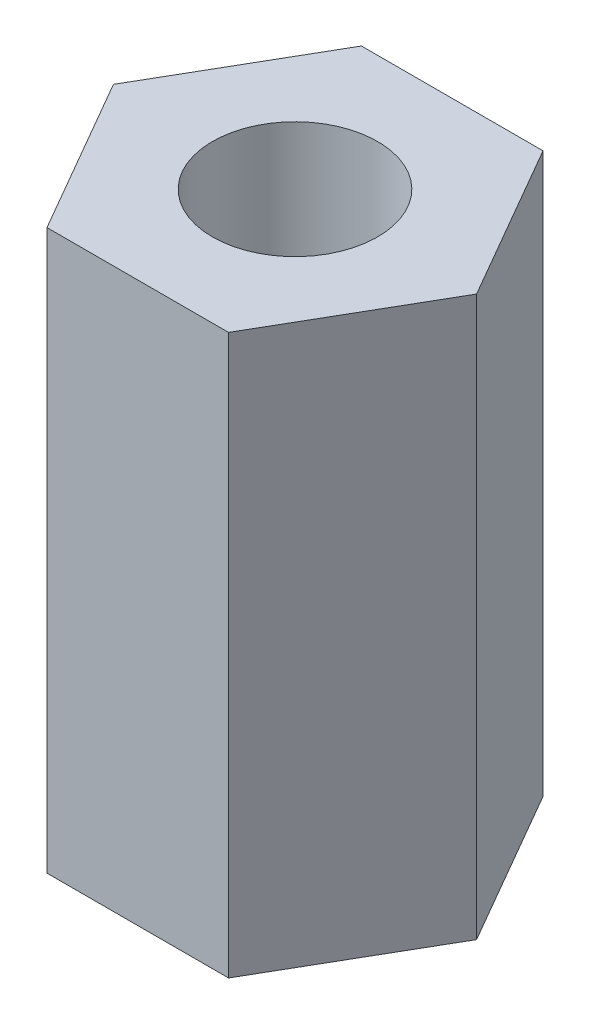
ISO-10303-21;
HEADER;
FILE_DESCRIPTION(('STEP AP214'),'2;1');
FILE_NAME('part.step','',(''),(''),'','','');
FILE_SCHEMA(('AUTOMOTIVE_DESIGN { 1 0 10303 214 1 1 1 1 }'));
ENDSEC;
DATA;
#1=APPLICATION_CONTEXT('core data for automotive mechanical design processes');
#2=APPLICATION_PROTOCOL_DEFINITION('international standard','automotive_design',2000,#1);
#3=PRODUCT_CONTEXT('',#1,'mechanical');
#4=PRODUCT('Part','Part','',(#3));
#5=PRODUCT_RELATED_PRODUCT_CATEGORY('part','',(#4));
#6=PRODUCT_DEFINITION_FORMATION('','',#4);
#7=PRODUCT_DEFINITION_CONTEXT('part definition',#1,'design');
#8=PRODUCT_DEFINITION('design','',#6,#7);
#9=PRODUCT_DEFINITION_SHAPE('','',#8);
#10=(LENGTH_UNIT() NAMED_UNIT(*) SI_UNIT(.MILLI.,.METRE.));
#11=(NAMED_UNIT(*) PLANE_ANGLE_UNIT() SI_UNIT($,.RADIAN.));
#12=(NAMED_UNIT(*) SI_UNIT($,.STERADIAN.) SOLID_ANGLE_UNIT());
#13=UNCERTAINTY_MEASURE_WITH_UNIT(LENGTH_MEASURE(1.E-05),#10,'distance_accuracy_value','');
#14=(GEOMETRIC_REPRESENTATION_CONTEXT(3) GLOBAL_UNCERTAINTY_ASSIGNED_CONTEXT((#13)) GLOBAL_UNIT_ASSIGNED_CONTEXT((#10,
#11,#12)) REPRESENTATION_CONTEXT('',''));
#15=CARTESIAN_POINT('',(0.,0.,0.));
#16=DIRECTION('',(0.,0.,1.));
#17=DIRECTION('',(1.,0.,0.));
#18=AXIS2_PLACEMENT_3D('',#15,#16,#17);
#19=CARTESIAN_POINT('',(0.,8.,0.));
#20=DIRECTION('',(0.,1.,0.));
#21=DIRECTION('',(0.,0.,1.));
#22=AXIS2_PLACEMENT_3D('',#19,#20,#21);
#23=PLANE('',#22);
#24=DIRECTION('',(0.499999999999995,0.,-0.866025403784442));
#25=VECTOR('',#24,1.);
#26=CARTESIAN_POINT('',(1.29903810567668,8.,2.24999999999998));
#27=LINE('',#26,#25);
#28=CARTESIAN_POINT('',(1.29903810567668,8.,2.24999999999998));
#29=VERTEX_POINT('',#28);
#30=CARTESIAN_POINT('',(2.59807621135331,8.,0.));
#31=VERTEX_POINT('',#30);
#32=EDGE_CURVE('E133',#29,#31,#27,.T.);
#33=ORIENTED_EDGE('',*,*,#32,.T.);
#34=DIRECTION('',(-0.500000000000001,0.,-0.866025403784438));
#35=VECTOR('',#34,1.);
#36=CARTESIAN_POINT('',(2.59807621135331,8.,0.));
#37=LINE('',#36,#35);
#38=CARTESIAN_POINT('',(1.29903810567665,8.,-2.25));
#39=VERTEX_POINT('',#38);
#40=EDGE_CURVE('E91',#31,#39,#37,.T.);
#41=ORIENTED_EDGE('',*,*,#40,.T.);
#42=DIRECTION('',(-1.,0.,0.));
#43=VECTOR('',#42,1.);
#44=CARTESIAN_POINT('',(1.29903810567665,8.,-2.25));
#45=LINE('',#44,#43);
#46=CARTESIAN_POINT('',(-1.29903810567667,8.,-2.24999999999999));
#47=VERTEX_POINT('',#46);
#48=EDGE_CURVE('E104',#39,#47,#45,.T.);
#49=ORIENTED_EDGE('',*,*,#48,.T.);
#50=DIRECTION('',(-0.499999999999995,0.,0.866025403784442));
#51=VECTOR('',#50,1.);
#52=CARTESIAN_POINT('',(-1.29903810567667,8.,-2.24999999999999));
#53=LINE('',#52,#51);
#54=CARTESIAN_POINT('',(-2.59807621135331,8.,0.));
#55=VERTEX_POINT('',#54);
#56=EDGE_CURVE('E98',#47,#55,#53,.T.);
#57=ORIENTED_EDGE('',*,*,#56,.T.);
#58=DIRECTION('',(0.500000000000007,0.,0.866025403784435));
#59=VECTOR('',#58,1.);
#60=CARTESIAN_POINT('',(-2.59807621135331,8.,0.));
#61=LINE('',#60,#59);
#62=CARTESIAN_POINT('',(-1.29903810567663,8.,2.25000000000001));
#63=VERTEX_POINT('',#62);
#64=EDGE_CURVE('E102',#55,#63,#61,.T.);
#65=ORIENTED_EDGE('',*,*,#64,.T.);
#66=DIRECTION('',(1.,0.,0.));
#67=VECTOR('',#66,1.);
#68=CARTESIAN_POINT('',(-1.29903810567663,8.,2.25000000000001));
#69=LINE('',#68,#67);
#70=EDGE_CURVE('E54',#63,#29,#69,.T.);
#71=ORIENTED_EDGE('',*,*,#70,.T.);
#72=EDGE_LOOP('',(#33,#41,#49,#57,#65,#71));
#73=FACE_BOUND('',#72,.T.);
#74=CARTESIAN_POINT('',(0.,8.,0.));
#75=DIRECTION('',(0.,1.,0.));
#76=DIRECTION('',(0.,0.,1.));
#77=AXIS2_PLACEMENT_3D('',#74,#75,#76);
#78=CIRCLE('',#77,1.18255525886135);
#79=CARTESIAN_POINT('',(0.,8.,1.18255525886135));
#80=VERTEX_POINT('',#79);
#81=EDGE_CURVE('E126',#80,#80,#78,.T.);
#82=ORIENTED_EDGE('',*,*,#81,.F.);
#83=EDGE_LOOP('',(#82));
#84=FACE_BOUND('',#83,.T.);
#85=ADVANCED_FACE('F37',(#73,#84),#23,.T.);
#86=CARTESIAN_POINT('',(0.,0.,0.));
#87=DIRECTION('',(0.,1.,0.));
#88=DIRECTION('',(0.,0.,1.));
#89=AXIS2_PLACEMENT_3D('',#86,#87,#88);
#90=PLANE('',#89);
#91=DIRECTION('',(0.499999999999995,0.,-0.866025403784442));
#92=VECTOR('',#91,1.);
#93=CARTESIAN_POINT('',(1.29903810567668,0.,2.24999999999998));
#94=LINE('',#93,#92);
#95=CARTESIAN_POINT('',(1.29903810567668,0.,2.24999999999998));
#96=VERTEX_POINT('',#95);
#97=CARTESIAN_POINT('',(2.59807621135331,0.,0.));
#98=VERTEX_POINT('',#97);
#99=EDGE_CURVE('E122',#96,#98,#94,.T.);
#100=ORIENTED_EDGE('',*,*,#99,.F.);
#101=DIRECTION('',(1.,0.,0.));
#102=VECTOR('',#101,1.);
#103=CARTESIAN_POINT('',(-1.29903810567663,0.,2.25000000000001));
#104=LINE('',#103,#102);
#105=CARTESIAN_POINT('',(-1.29903810567663,0.,2.25000000000001));
#106=VERTEX_POINT('',#105);
#107=EDGE_CURVE('E83',#106,#96,#104,.T.);
#108=ORIENTED_EDGE('',*,*,#107,.F.);
#109=DIRECTION('',(0.500000000000007,0.,0.866025403784435));
#110=VECTOR('',#109,1.);
#111=CARTESIAN_POINT('',(-2.59807621135331,0.,0.));
#112=LINE('',#111,#110);
#113=CARTESIAN_POINT('',(-2.59807621135331,0.,0.));
#114=VERTEX_POINT('',#113);
#115=EDGE_CURVE('E77',#114,#106,#112,.T.);
#116=ORIENTED_EDGE('',*,*,#115,.F.);
#117=DIRECTION('',(-0.499999999999995,0.,0.866025403784442));
#118=VECTOR('',#117,1.);
#119=CARTESIAN_POINT('',(-1.29903810567667,0.,-2.24999999999999));
#120=LINE('',#119,#118);
#121=CARTESIAN_POINT('',(-1.29903810567667,0.,-2.24999999999999));
#122=VERTEX_POINT('',#121);
#123=EDGE_CURVE('E112',#122,#114,#120,.T.);
#124=ORIENTED_EDGE('',*,*,#123,.F.);
#125=DIRECTION('',(-1.,0.,0.));
#126=VECTOR('',#125,1.);
#127=CARTESIAN_POINT('',(1.29903810567665,0.,-2.25));
#128=LINE('',#127,#126);
#129=CARTESIAN_POINT('',(1.29903810567665,0.,-2.25));
#130=VERTEX_POINT('',#129);
#131=EDGE_CURVE('E128',#130,#122,#128,.T.);
#132=ORIENTED_EDGE('',*,*,#131,.F.);
#133=DIRECTION('',(-0.500000000000001,0.,-0.866025403784438));
#134=VECTOR('',#133,1.);
#135=CARTESIAN_POINT('',(2.59807621135331,0.,0.));
#136=LINE('',#135,#134);
#137=EDGE_CURVE('E125',#98,#130,#136,.T.);
#138=ORIENTED_EDGE('',*,*,#137,.F.);
#139=EDGE_LOOP('',(#100,#108,#116,#124,#132,#138));
#140=FACE_BOUND('',#139,.T.);
#141=CARTESIAN_POINT('',(0.,0.,0.));
#142=DIRECTION('',(0.,1.,0.));
#143=DIRECTION('',(0.,0.,1.));
#144=AXIS2_PLACEMENT_3D('',#141,#142,#143);
#145=CIRCLE('',#144,1.18255525886135);
#146=CARTESIAN_POINT('',(0.,0.,1.18255525886135));
#147=VERTEX_POINT('',#146);
#148=EDGE_CURVE('E226',#147,#147,#145,.T.);
#149=ORIENTED_EDGE('',*,*,#148,.T.);
#150=EDGE_LOOP('',(#149));
#151=FACE_BOUND('',#150,.T.);
#152=ADVANCED_FACE('F142',(#140,#151),#90,.F.);
#153=CARTESIAN_POINT('',(1.29903810567668,8.,2.24999999999998));
#154=DIRECTION('',(-0.866025403784442,0.,-0.499999999999995));
#155=DIRECTION('',(-0.499999999999995,0.,0.866025403784442));
#156=AXIS2_PLACEMENT_3D('',#153,#154,#155);
#157=PLANE('',#156);
#158=ORIENTED_EDGE('',*,*,#99,.T.);
#159=DIRECTION('',(0.,-1.,0.));
#160=VECTOR('',#159,1.);
#161=CARTESIAN_POINT('',(2.59807621135331,8.,0.));
#162=LINE('',#161,#160);
#163=EDGE_CURVE('E11',#31,#98,#162,.T.);
#164=ORIENTED_EDGE('',*,*,#163,.F.);
#165=ORIENTED_EDGE('',*,*,#32,.F.);
#166=DIRECTION('',(0.,-1.,0.));
#167=VECTOR('',#166,1.);
#168=CARTESIAN_POINT('',(1.29903810567668,8.,2.24999999999998));
#169=LINE('',#168,#167);
#170=EDGE_CURVE('E118',#29,#96,#169,.T.);
#171=ORIENTED_EDGE('',*,*,#170,.T.);
#172=EDGE_LOOP('',(#158,#164,#165,#171));
#173=FACE_BOUND('',#172,.T.);
#174=ADVANCED_FACE('F39',(#173),#157,.F.);
#175=CARTESIAN_POINT('',(2.59807621135331,8.,0.));
#176=DIRECTION('',(-0.866025403784438,0.,0.500000000000001));
#177=DIRECTION('',(0.500000000000001,0.,0.866025403784438));
#178=AXIS2_PLACEMENT_3D('',#175,#176,#177);
#179=PLANE('',#178);
#180=ORIENTED_EDGE('',*,*,#137,.T.);
#181=DIRECTION('',(0.,-1.,0.));
#182=VECTOR('',#181,1.);
#183=CARTESIAN_POINT('',(1.29903810567665,8.,-2.25));
#184=LINE('',#183,#182);
#185=EDGE_CURVE('E46',#39,#130,#184,.T.);
#186=ORIENTED_EDGE('',*,*,#185,.F.);
#187=ORIENTED_EDGE('',*,*,#40,.F.);
#188=ORIENTED_EDGE('',*,*,#163,.T.);
#189=EDGE_LOOP('',(#180,#186,#187,#188));
#190=FACE_BOUND('',#189,.T.);
#191=ADVANCED_FACE('F167',(#190),#179,.F.);
#192=CARTESIAN_POINT('',(1.29903810567665,8.,-2.25));
#193=DIRECTION('',(0.,0.,1.));
#194=DIRECTION('',(1.,0.,0.));
#195=AXIS2_PLACEMENT_3D('',#192,#193,#194);
#196=PLANE('',#195);
#197=ORIENTED_EDGE('',*,*,#131,.T.);
#198=DIRECTION('',(0.,-1.,0.));
#199=VECTOR('',#198,1.);
#200=CARTESIAN_POINT('',(-1.29903810567667,8.,-2.24999999999999));
#201=LINE('',#200,#199);
#202=EDGE_CURVE('E113',#47,#122,#201,.T.);
#203=ORIENTED_EDGE('',*,*,#202,.F.);
#204=ORIENTED_EDGE('',*,*,#48,.F.);
#205=ORIENTED_EDGE('',*,*,#185,.T.);
#206=EDGE_LOOP('',(#197,#203,#204,#205));
#207=FACE_BOUND('',#206,.T.);
#208=ADVANCED_FACE('F139',(#207),#196,.F.);
#209=CARTESIAN_POINT('',(-1.29903810567667,8.,-2.24999999999999));
#210=DIRECTION('',(0.866025403784442,0.,0.499999999999995));
#211=DIRECTION('',(0.499999999999995,0.,-0.866025403784442));
#212=AXIS2_PLACEMENT_3D('',#209,#210,#211);
#213=PLANE('',#212);
#214=ORIENTED_EDGE('',*,*,#123,.T.);
#215=DIRECTION('',(0.,-1.,0.));
#216=VECTOR('',#215,1.);
#217=CARTESIAN_POINT('',(-2.59807621135331,8.,0.));
#218=LINE('',#217,#216);
#219=EDGE_CURVE('E109',#55,#114,#218,.T.);
#220=ORIENTED_EDGE('',*,*,#219,.F.);
#221=ORIENTED_EDGE('',*,*,#56,.F.);
#222=ORIENTED_EDGE('',*,*,#202,.T.);
#223=EDGE_LOOP('',(#214,#220,#221,#222));
#224=FACE_BOUND('',#223,.T.);
#225=ADVANCED_FACE('F110',(#224),#213,.F.);
#226=CARTESIAN_POINT('',(-2.59807621135331,8.,0.));
#227=DIRECTION('',(0.866025403784435,0.,-0.500000000000007));
#228=DIRECTION('',(-0.500000000000007,0.,-0.866025403784435));
#229=AXIS2_PLACEMENT_3D('',#226,#227,#228);
#230=PLANE('',#229);
#231=ORIENTED_EDGE('',*,*,#115,.T.);
#232=DIRECTION('',(0.,-1.,0.));
#233=VECTOR('',#232,1.);
#234=CARTESIAN_POINT('',(-1.29903810567663,8.,2.25000000000001));
#235=LINE('',#234,#233);
#236=EDGE_CURVE('E114',#63,#106,#235,.T.);
#237=ORIENTED_EDGE('',*,*,#236,.F.);
#238=ORIENTED_EDGE('',*,*,#64,.F.);
#239=ORIENTED_EDGE('',*,*,#219,.T.);
#240=EDGE_LOOP('',(#231,#237,#238,#239));
#241=FACE_BOUND('',#240,.T.);
#242=ADVANCED_FACE('F116',(#241),#230,.F.);
#243=CARTESIAN_POINT('',(-1.29903810567663,8.,2.25000000000001));
#244=DIRECTION('',(0.,0.,-1.));
#245=DIRECTION('',(-1.,0.,0.));
#246=AXIS2_PLACEMENT_3D('',#243,#244,#245);
#247=PLANE('',#246);
#248=ORIENTED_EDGE('',*,*,#107,.T.);
#249=ORIENTED_EDGE('',*,*,#170,.F.);
#250=ORIENTED_EDGE('',*,*,#70,.F.);
#251=ORIENTED_EDGE('',*,*,#236,.T.);
#252=EDGE_LOOP('',(#248,#249,#250,#251));
#253=FACE_BOUND('',#252,.T.);
#254=ADVANCED_FACE('F147',(#253),#247,.F.);
#255=CARTESIAN_POINT('',(0.,8.,0.));
#256=DIRECTION('',(0.,-1.,0.));
#257=DIRECTION('',(0.,0.,-1.));
#258=AXIS2_PLACEMENT_3D('',#255,#256,#257);
#259=CYLINDRICAL_SURFACE('',#258,1.18255525886135);
#260=ORIENTED_EDGE('',*,*,#81,.T.);
#261=EDGE_LOOP('',(#260));
#262=FACE_BOUND('',#261,.T.);
#263=ORIENTED_EDGE('',*,*,#148,.F.);
#264=EDGE_LOOP('',(#263));
#265=FACE_BOUND('',#264,.T.);
#266=ADVANCED_FACE('F149',(#262,#265),#259,.F.);
#267=CLOSED_SHELL('',(#85,#152,#174,#191,#208,#225,#242,#254,#266));
#268=MANIFOLD_SOLID_BREP('B2',#267);
#269=ADVANCED_BREP_SHAPE_REPRESENTATION('',(#18,#268),#14);
#270=SHAPE_DEFINITION_REPRESENTATION(#9,#269);
ENDSEC;
END-ISO-10303-21;
